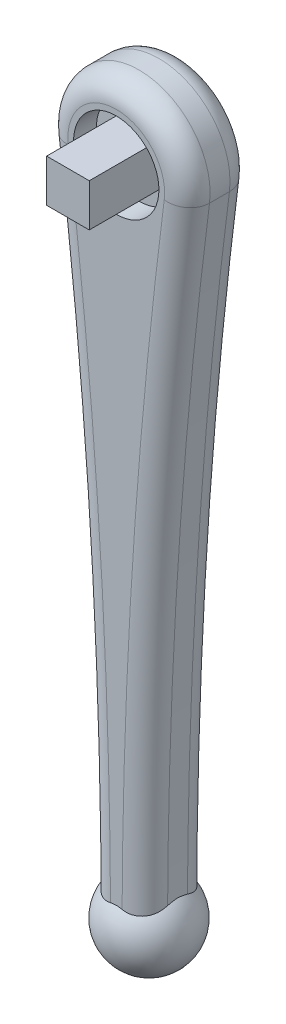
ISO-10303-21;
HEADER;
FILE_DESCRIPTION(('STEP AP214'),'2;1');
FILE_NAME('part.step','',(''),(''),'','','');
FILE_SCHEMA(('AUTOMOTIVE_DESIGN { 1 0 10303 214 1 1 1 1 }'));
ENDSEC;
DATA;
#1=APPLICATION_CONTEXT('core data for automotive mechanical design processes');
#2=APPLICATION_PROTOCOL_DEFINITION('international standard','automotive_design',2000,#1);
#3=PRODUCT_CONTEXT('',#1,'mechanical');
#4=PRODUCT('Part','Part','',(#3));
#5=PRODUCT_RELATED_PRODUCT_CATEGORY('part','',(#4));
#6=PRODUCT_DEFINITION_FORMATION('','',#4);
#7=PRODUCT_DEFINITION_CONTEXT('part definition',#1,'design');
#8=PRODUCT_DEFINITION('design','',#6,#7);
#9=PRODUCT_DEFINITION_SHAPE('','',#8);
#10=(LENGTH_UNIT() NAMED_UNIT(*) SI_UNIT(.MILLI.,.METRE.));
#11=(NAMED_UNIT(*) PLANE_ANGLE_UNIT() SI_UNIT($,.RADIAN.));
#12=(NAMED_UNIT(*) SI_UNIT($,.STERADIAN.) SOLID_ANGLE_UNIT());
#13=UNCERTAINTY_MEASURE_WITH_UNIT(LENGTH_MEASURE(1.E-05),#10,'distance_accuracy_value','');
#14=(GEOMETRIC_REPRESENTATION_CONTEXT(3) GLOBAL_UNCERTAINTY_ASSIGNED_CONTEXT((#13)) GLOBAL_UNIT_ASSIGNED_CONTEXT((#10,
#11,#12)) REPRESENTATION_CONTEXT('',''));
#15=CARTESIAN_POINT('',(0.,0.,0.));
#16=DIRECTION('',(0.,0.,1.));
#17=DIRECTION('',(1.,0.,0.));
#18=AXIS2_PLACEMENT_3D('',#15,#16,#17);
#19=CARTESIAN_POINT('',(0.,-235.,-3.5));
#20=DIRECTION('',(0.,1.,0.));
#21=DIRECTION('',(1.,0.,0.));
#22=AXIS2_PLACEMENT_3D('',#19,#20,#21);
#23=SPHERICAL_SURFACE('',#22,15.);
#24=CARTESIAN_POINT('',(0.,-220.,-3.5));
#25=VERTEX_POINT('',#24);
#26=VERTEX_LOOP('',#25);
#27=FACE_BOUND('',#26,.T.);
#28=ADVANCED_FACE('F41',(#27),#23,.T.);
#29=CLOSED_SHELL('',(#28));
#30=MANIFOLD_SOLID_BREP('B2',#29);
#31=CARTESIAN_POINT('',(1.17837495185956E-13,11.25,-18.5));
#32=DIRECTION('',(0.,0.,1.));
#33=DIRECTION('',(1.,0.,0.));
#34=AXIS2_PLACEMENT_3D('',#31,#32,#33);
#35=CYLINDRICAL_SURFACE('',#34,1.5);
#36=CARTESIAN_POINT('',(1.17837495185956E-13,11.25,0.));
#37=DIRECTION('',(0.,0.,-1.));
#38=DIRECTION('',(-1.,0.,0.));
#39=AXIS2_PLACEMENT_3D('',#36,#37,#38);
#40=CIRCLE('',#39,1.5);
#41=CARTESIAN_POINT('',(-1.49999999999988,11.25,0.));
#42=VERTEX_POINT('',#41);
#43=EDGE_CURVE('E385',#42,#42,#40,.T.);
#44=ORIENTED_EDGE('',*,*,#43,.F.);
#45=EDGE_LOOP('',(#44));
#46=FACE_BOUND('',#45,.T.);
#47=CARTESIAN_POINT('',(1.17837495185956E-13,11.25,-6.));
#48=DIRECTION('',(0.,0.,-1.));
#49=DIRECTION('',(-1.,0.,0.));
#50=AXIS2_PLACEMENT_3D('',#47,#48,#49);
#51=CIRCLE('',#50,1.5);
#52=CARTESIAN_POINT('',(-1.49999999999988,11.25,-6.));
#53=VERTEX_POINT('',#52);
#54=EDGE_CURVE('E58',#53,#53,#51,.F.);
#55=ORIENTED_EDGE('',*,*,#54,.F.);
#56=EDGE_LOOP('',(#55));
#57=FACE_BOUND('',#56,.T.);
#58=ADVANCED_FACE('F54',(#46,#57),#35,.F.);
#59=CARTESIAN_POINT('',(-11.25,0.,-18.5));
#60=DIRECTION('',(0.,0.,1.));
#61=DIRECTION('',(1.,0.,0.));
#62=AXIS2_PLACEMENT_3D('',#59,#60,#61);
#63=CYLINDRICAL_SURFACE('',#62,1.5);
#64=CARTESIAN_POINT('',(-11.25,0.,0.));
#65=DIRECTION('',(0.,0.,-1.));
#66=DIRECTION('',(-1.,0.,0.));
#67=AXIS2_PLACEMENT_3D('',#64,#65,#66);
#68=CIRCLE('',#67,1.5);
#69=CARTESIAN_POINT('',(-12.75,0.,0.));
#70=VERTEX_POINT('',#69);
#71=EDGE_CURVE('E382',#70,#70,#68,.T.);
#72=ORIENTED_EDGE('',*,*,#71,.F.);
#73=EDGE_LOOP('',(#72));
#74=FACE_BOUND('',#73,.T.);
#75=CARTESIAN_POINT('',(-11.25,0.,-6.));
#76=DIRECTION('',(0.,0.,-1.));
#77=DIRECTION('',(-1.,0.,0.));
#78=AXIS2_PLACEMENT_3D('',#75,#76,#77);
#79=CIRCLE('',#78,1.5);
#80=CARTESIAN_POINT('',(-12.75,0.,-6.));
#81=VERTEX_POINT('',#80);
#82=EDGE_CURVE('E409',#81,#81,#79,.T.);
#83=ORIENTED_EDGE('',*,*,#82,.T.);
#84=EDGE_LOOP('',(#83));
#85=FACE_BOUND('',#84,.T.);
#86=ADVANCED_FACE('F306',(#74,#85),#63,.F.);
#87=CARTESIAN_POINT('',(0.,-11.25,-18.5));
#88=DIRECTION('',(0.,0.,1.));
#89=DIRECTION('',(1.,0.,0.));
#90=AXIS2_PLACEMENT_3D('',#87,#88,#89);
#91=CYLINDRICAL_SURFACE('',#90,1.5);
#92=CARTESIAN_POINT('',(0.,-11.25,0.));
#93=DIRECTION('',(0.,0.,-1.));
#94=DIRECTION('',(-1.,0.,0.));
#95=AXIS2_PLACEMENT_3D('',#92,#93,#94);
#96=CIRCLE('',#95,1.5);
#97=CARTESIAN_POINT('',(-1.50000000000004,-11.25,0.));
#98=VERTEX_POINT('',#97);
#99=EDGE_CURVE('E379',#98,#98,#96,.T.);
#100=ORIENTED_EDGE('',*,*,#99,.F.);
#101=EDGE_LOOP('',(#100));
#102=FACE_BOUND('',#101,.T.);
#103=CARTESIAN_POINT('',(0.,-11.25,-6.));
#104=DIRECTION('',(0.,0.,-1.));
#105=DIRECTION('',(-1.,0.,0.));
#106=AXIS2_PLACEMENT_3D('',#103,#104,#105);
#107=CIRCLE('',#106,1.5);
#108=CARTESIAN_POINT('',(-1.50000000000004,-11.25,-6.));
#109=VERTEX_POINT('',#108);
#110=EDGE_CURVE('E401',#109,#109,#107,.T.);
#111=ORIENTED_EDGE('',*,*,#110,.T.);
#112=EDGE_LOOP('',(#111));
#113=FACE_BOUND('',#112,.T.);
#114=ADVANCED_FACE('F312',(#102,#113),#91,.F.);
#115=CARTESIAN_POINT('',(11.25,0.,-18.5));
#116=DIRECTION('',(0.,0.,1.));
#117=DIRECTION('',(1.,0.,0.));
#118=AXIS2_PLACEMENT_3D('',#115,#116,#117);
#119=CYLINDRICAL_SURFACE('',#118,1.5);
#120=CARTESIAN_POINT('',(11.25,0.,0.));
#121=DIRECTION('',(0.,0.,-1.));
#122=DIRECTION('',(-1.,0.,0.));
#123=AXIS2_PLACEMENT_3D('',#120,#121,#122);
#124=CIRCLE('',#123,1.5);
#125=CARTESIAN_POINT('',(9.75,0.,0.));
#126=VERTEX_POINT('',#125);
#127=EDGE_CURVE('E231',#126,#126,#124,.T.);
#128=ORIENTED_EDGE('',*,*,#127,.F.);
#129=EDGE_LOOP('',(#128));
#130=FACE_BOUND('',#129,.T.);
#131=CARTESIAN_POINT('',(11.25,0.,-6.));
#132=DIRECTION('',(0.,0.,-1.));
#133=DIRECTION('',(-1.,0.,0.));
#134=AXIS2_PLACEMENT_3D('',#131,#132,#133);
#135=CIRCLE('',#134,1.5);
#136=CARTESIAN_POINT('',(9.75,0.,-6.));
#137=VERTEX_POINT('',#136);
#138=EDGE_CURVE('E395',#137,#137,#135,.T.);
#139=ORIENTED_EDGE('',*,*,#138,.T.);
#140=EDGE_LOOP('',(#139));
#141=FACE_BOUND('',#140,.T.);
#142=ADVANCED_FACE('F299',(#130,#141),#119,.F.);
#143=CARTESIAN_POINT('',(0.,0.,8.));
#144=DIRECTION('',(0.,0.,-1.));
#145=DIRECTION('',(-1.,0.,0.));
#146=AXIS2_PLACEMENT_3D('',#143,#144,#145);
#147=CYLINDRICAL_SURFACE('',#146,25.);
#148=DIRECTION('',(0.,0.,-1.));
#149=VECTOR('',#148,1.);
#150=CARTESIAN_POINT('',(-24.7971145175834,-3.1785392245266,254.854626136875));
#151=LINE('',#150,#149);
#152=CARTESIAN_POINT('',(-24.7971145175834,-3.1785392245266,0.));
#153=VERTEX_POINT('',#152);
#154=CARTESIAN_POINT('',(-24.7971145175834,-3.1785392245266,-7.00000000000001));
#155=VERTEX_POINT('',#154);
#156=EDGE_CURVE('E263',#153,#155,#151,.T.);
#157=ORIENTED_EDGE('',*,*,#156,.F.);
#158=CARTESIAN_POINT('',(0.,0.,0.));
#159=DIRECTION('',(0.,0.,1.));
#160=DIRECTION('',(1.,0.,0.));
#161=AXIS2_PLACEMENT_3D('',#158,#159,#160);
#162=CIRCLE('',#161,25.);
#163=CARTESIAN_POINT('',(24.7971145175834,-3.17853922452661,0.));
#164=VERTEX_POINT('',#163);
#165=EDGE_CURVE('E63',#153,#164,#162,.F.);
#166=ORIENTED_EDGE('',*,*,#165,.T.);
#167=DIRECTION('',(0.,0.,-1.));
#168=VECTOR('',#167,1.);
#169=CARTESIAN_POINT('',(24.7971145175834,-3.17853922452661,254.854626136875));
#170=LINE('',#169,#168);
#171=CARTESIAN_POINT('',(24.7971145175834,-3.17853922452661,-7.00000000000001));
#172=VERTEX_POINT('',#171);
#173=EDGE_CURVE('E265',#164,#172,#170,.T.);
#174=ORIENTED_EDGE('',*,*,#173,.T.);
#175=CARTESIAN_POINT('',(0.,0.,-7.));
#176=DIRECTION('',(0.,0.,-1.));
#177=DIRECTION('',(-1.,0.,0.));
#178=AXIS2_PLACEMENT_3D('',#175,#176,#177);
#179=CIRCLE('',#178,25.);
#180=EDGE_CURVE('E195',#172,#155,#179,.F.);
#181=ORIENTED_EDGE('',*,*,#180,.T.);
#182=EDGE_LOOP('',(#157,#166,#174,#181));
#183=FACE_BOUND('',#182,.T.);
#184=ADVANCED_FACE('F290',(#183),#147,.T.);
#185=CARTESIAN_POINT('',(0.,0.,0.));
#186=DIRECTION('',(0.,0.,-1.));
#187=DIRECTION('',(-1.,0.,0.));
#188=AXIS2_PLACEMENT_3D('',#185,#186,#187);
#189=PLANE('',#188);
#190=ORIENTED_EDGE('',*,*,#127,.T.);
#191=EDGE_LOOP('',(#190));
#192=FACE_BOUND('',#191,.T.);
#193=ORIENTED_EDGE('',*,*,#99,.T.);
#194=EDGE_LOOP('',(#193));
#195=FACE_BOUND('',#194,.T.);
#196=ORIENTED_EDGE('',*,*,#71,.T.);
#197=EDGE_LOOP('',(#196));
#198=FACE_BOUND('',#197,.T.);
#199=ORIENTED_EDGE('',*,*,#43,.T.);
#200=EDGE_LOOP('',(#199));
#201=FACE_BOUND('',#200,.T.);
#202=CARTESIAN_POINT('',(0.,0.,0.));
#203=DIRECTION('',(0.,0.,1.));
#204=DIRECTION('',(1.,0.,0.));
#205=AXIS2_PLACEMENT_3D('',#202,#203,#204);
#206=CIRCLE('',#205,15.);
#207=CARTESIAN_POINT('',(15.,0.,0.));
#208=VERTEX_POINT('',#207);
#209=EDGE_CURVE('E169',#208,#208,#206,.T.);
#210=ORIENTED_EDGE('',*,*,#209,.T.);
#211=EDGE_LOOP('',(#210));
#212=FACE_BOUND('',#211,.T.);
#213=DIRECTION('',(0.,1.,0.));
#214=VECTOR('',#213,1.);
#215=CARTESIAN_POINT('',(7.5,-7.5,0.));
#216=LINE('',#215,#214);
#217=CARTESIAN_POINT('',(7.5,-7.5,0.));
#218=VERTEX_POINT('',#217);
#219=CARTESIAN_POINT('',(7.5,7.5,0.));
#220=VERTEX_POINT('',#219);
#221=EDGE_CURVE('E168',#218,#220,#216,.T.);
#222=ORIENTED_EDGE('',*,*,#221,.F.);
#223=DIRECTION('',(1.,0.,0.));
#224=VECTOR('',#223,1.);
#225=CARTESIAN_POINT('',(-7.5,-7.5,0.));
#226=LINE('',#225,#224);
#227=CARTESIAN_POINT('',(-7.5,-7.5,0.));
#228=VERTEX_POINT('',#227);
#229=EDGE_CURVE('E165',#228,#218,#226,.T.);
#230=ORIENTED_EDGE('',*,*,#229,.F.);
#231=DIRECTION('',(0.,-1.,0.));
#232=VECTOR('',#231,1.);
#233=CARTESIAN_POINT('',(-7.5,-7.5,0.));
#234=LINE('',#233,#232);
#235=CARTESIAN_POINT('',(-7.5,7.5,0.));
#236=VERTEX_POINT('',#235);
#237=EDGE_CURVE('E276',#236,#228,#234,.T.);
#238=ORIENTED_EDGE('',*,*,#237,.F.);
#239=DIRECTION('',(-1.,0.,0.));
#240=VECTOR('',#239,1.);
#241=CARTESIAN_POINT('',(-7.5,7.5,0.));
#242=LINE('',#241,#240);
#243=EDGE_CURVE('E274',#220,#236,#242,.T.);
#244=ORIENTED_EDGE('',*,*,#243,.F.);
#245=EDGE_LOOP('',(#222,#230,#238,#244));
#246=FACE_BOUND('',#245,.T.);
#247=ADVANCED_FACE('F288',(#192,#195,#198,#201,#212,#246),#189,.F.);
#248=CARTESIAN_POINT('',(0.,0.,8.));
#249=DIRECTION('',(0.,0.,1.));
#250=DIRECTION('',(1.,0.,0.));
#251=AXIS2_PLACEMENT_3D('',#248,#249,#250);
#252=PLANE('',#251);
#253=CARTESIAN_POINT('',(-1833.33333333333,-235.,8.));
#254=DIRECTION('',(0.,0.,1.));
#255=DIRECTION('',(1.,0.,0.));
#256=AXIS2_PLACEMENT_3D('',#253,#254,#255);
#257=CIRCLE('',#256,1831.33333333333);
#258=CARTESIAN_POINT('',(-16.8620378719567,-2.16140667267809,8.));
#259=VERTEX_POINT('',#258);
#260=CARTESIAN_POINT('',(-2.00000000000026,-235.,8.));
#261=VERTEX_POINT('',#260);
#262=EDGE_CURVE('E221',#259,#261,#257,.F.);
#263=ORIENTED_EDGE('',*,*,#262,.T.);
#264=CARTESIAN_POINT('',(0.,-235.,8.));
#265=DIRECTION('',(0.,0.,1.));
#266=DIRECTION('',(1.,0.,0.));
#267=AXIS2_PLACEMENT_3D('',#264,#265,#266);
#268=CIRCLE('',#267,2.00000000000001);
#269=CARTESIAN_POINT('',(1.99999999999998,-235.,8.));
#270=VERTEX_POINT('',#269);
#271=EDGE_CURVE('E223',#261,#270,#268,.T.);
#272=ORIENTED_EDGE('',*,*,#271,.T.);
#273=CARTESIAN_POINT('',(1833.33333333333,-235.,8.));
#274=DIRECTION('',(0.,0.,1.));
#275=DIRECTION('',(1.,0.,0.));
#276=AXIS2_PLACEMENT_3D('',#273,#274,#275);
#277=CIRCLE('',#276,1831.33333333333);
#278=CARTESIAN_POINT('',(16.8620378719569,-2.16140667267812,8.));
#279=VERTEX_POINT('',#278);
#280=EDGE_CURVE('E217',#270,#279,#277,.F.);
#281=ORIENTED_EDGE('',*,*,#280,.T.);
#282=CARTESIAN_POINT('',(0.,0.,8.));
#283=DIRECTION('',(0.,0.,1.));
#284=DIRECTION('',(1.,0.,0.));
#285=AXIS2_PLACEMENT_3D('',#282,#283,#284);
#286=CIRCLE('',#285,17.);
#287=EDGE_CURVE('E219',#279,#259,#286,.T.);
#288=ORIENTED_EDGE('',*,*,#287,.T.);
#289=EDGE_LOOP('',(#263,#272,#281,#288));
#290=FACE_BOUND('',#289,.T.);
#291=CARTESIAN_POINT('',(0.,0.,8.));
#292=DIRECTION('',(0.,0.,1.));
#293=DIRECTION('',(1.,0.,0.));
#294=AXIS2_PLACEMENT_3D('',#291,#292,#293);
#295=CIRCLE('',#294,15.);
#296=CARTESIAN_POINT('',(15.,0.,8.));
#297=VERTEX_POINT('',#296);
#298=EDGE_CURVE('E172',#297,#297,#295,.T.);
#299=ORIENTED_EDGE('',*,*,#298,.F.);
#300=EDGE_LOOP('',(#299));
#301=FACE_BOUND('',#300,.T.);
#302=ADVANCED_FACE('F247',(#290,#301),#252,.T.);
#303=CARTESIAN_POINT('',(0.,0.,8.));
#304=DIRECTION('',(0.,0.,-1.));
#305=DIRECTION('',(-1.,0.,0.));
#306=AXIS2_PLACEMENT_3D('',#303,#304,#305);
#307=CYLINDRICAL_SURFACE('',#306,15.);
#308=ORIENTED_EDGE('',*,*,#298,.T.);
#309=EDGE_LOOP('',(#308));
#310=FACE_BOUND('',#309,.T.);
#311=ORIENTED_EDGE('',*,*,#209,.F.);
#312=EDGE_LOOP('',(#311));
#313=FACE_BOUND('',#312,.T.);
#314=ADVANCED_FACE('F297',(#310,#313),#307,.F.);
#315=CARTESIAN_POINT('',(0.,0.,-15.));
#316=DIRECTION('',(0.,0.,-1.));
#317=DIRECTION('',(-1.,0.,0.));
#318=AXIS2_PLACEMENT_3D('',#315,#316,#317);
#319=PLANE('',#318);
#320=CARTESIAN_POINT('',(-11.2500000000003,4.38270590102521E-13,-15.));
#321=DIRECTION('',(0.,0.,-1.));
#322=DIRECTION('',(-1.,0.,0.));
#323=AXIS2_PLACEMENT_3D('',#320,#321,#322);
#324=CIRCLE('',#323,3.50000000000025);
#325=CARTESIAN_POINT('',(-14.7500000000006,4.38270590102521E-13,-15.));
#326=VERTEX_POINT('',#325);
#327=EDGE_CURVE('E347',#326,#326,#324,.T.);
#328=ORIENTED_EDGE('',*,*,#327,.F.);
#329=EDGE_LOOP('',(#328));
#330=FACE_BOUND('',#329,.T.);
#331=CARTESIAN_POINT('',(-7.58703685019087E-13,-11.25,-15.));
#332=DIRECTION('',(0.,0.,-1.));
#333=DIRECTION('',(-1.,0.,0.));
#334=AXIS2_PLACEMENT_3D('',#331,#332,#333);
#335=CIRCLE('',#334,3.50000000000069);
#336=CARTESIAN_POINT('',(-3.50000000000145,-11.25,-15.));
#337=VERTEX_POINT('',#336);
#338=EDGE_CURVE('E351',#337,#337,#335,.T.);
#339=ORIENTED_EDGE('',*,*,#338,.F.);
#340=EDGE_LOOP('',(#339));
#341=FACE_BOUND('',#340,.T.);
#342=CARTESIAN_POINT('',(11.2499999999997,-4.39648317751562E-13,-15.));
#343=DIRECTION('',(0.,0.,-1.));
#344=DIRECTION('',(-1.,0.,0.));
#345=AXIS2_PLACEMENT_3D('',#342,#343,#344);
#346=CIRCLE('',#345,3.50000000000051);
#347=CARTESIAN_POINT('',(7.74999999999917,-4.39648317751562E-13,-15.));
#348=VERTEX_POINT('',#347);
#349=EDGE_CURVE('E355',#348,#348,#346,.T.);
#350=ORIENTED_EDGE('',*,*,#349,.F.);
#351=EDGE_LOOP('',(#350));
#352=FACE_BOUND('',#351,.T.);
#353=CARTESIAN_POINT('',(1.17837495185956E-13,11.25,-15.));
#354=DIRECTION('',(0.,0.,-1.));
#355=DIRECTION('',(-1.,0.,0.));
#356=AXIS2_PLACEMENT_3D('',#353,#354,#355);
#357=CIRCLE('',#356,3.5);
#358=CARTESIAN_POINT('',(-3.49999999999988,11.25,-15.));
#359=VERTEX_POINT('',#358);
#360=EDGE_CURVE('E359',#359,#359,#357,.T.);
#361=ORIENTED_EDGE('',*,*,#360,.F.);
#362=EDGE_LOOP('',(#361));
#363=FACE_BOUND('',#362,.T.);
#364=CARTESIAN_POINT('',(1833.33333333333,-235.,-15.));
#365=DIRECTION('',(0.,0.,-1.));
#366=DIRECTION('',(-1.,0.,0.));
#367=AXIS2_PLACEMENT_3D('',#364,#365,#366);
#368=CIRCLE('',#367,1831.33333333333);
#369=CARTESIAN_POINT('',(16.8620378719569,-2.16140667267812,-15.));
#370=VERTEX_POINT('',#369);
#371=CARTESIAN_POINT('',(1.99999999999998,-235.,-15.));
#372=VERTEX_POINT('',#371);
#373=EDGE_CURVE('E179',#370,#372,#368,.F.);
#374=ORIENTED_EDGE('',*,*,#373,.T.);
#375=CARTESIAN_POINT('',(0.,-235.,-15.));
#376=DIRECTION('',(0.,0.,-1.));
#377=DIRECTION('',(-1.,0.,0.));
#378=AXIS2_PLACEMENT_3D('',#375,#376,#377);
#379=CIRCLE('',#378,2.00000000000001);
#380=CARTESIAN_POINT('',(-2.00000000000026,-235.,-15.));
#381=VERTEX_POINT('',#380);
#382=EDGE_CURVE('E186',#372,#381,#379,.T.);
#383=ORIENTED_EDGE('',*,*,#382,.T.);
#384=CARTESIAN_POINT('',(-1833.33333333333,-235.,-15.));
#385=DIRECTION('',(0.,0.,-1.));
#386=DIRECTION('',(-1.,0.,0.));
#387=AXIS2_PLACEMENT_3D('',#384,#385,#386);
#388=CIRCLE('',#387,1831.33333333333);
#389=CARTESIAN_POINT('',(-16.8620378719567,-2.16140667267809,-15.));
#390=VERTEX_POINT('',#389);
#391=EDGE_CURVE('E184',#381,#390,#388,.F.);
#392=ORIENTED_EDGE('',*,*,#391,.T.);
#393=CARTESIAN_POINT('',(0.,0.,-15.));
#394=DIRECTION('',(0.,0.,-1.));
#395=DIRECTION('',(-1.,0.,0.));
#396=AXIS2_PLACEMENT_3D('',#393,#394,#395);
#397=CIRCLE('',#396,17.);
#398=EDGE_CURVE('E182',#390,#370,#397,.T.);
#399=ORIENTED_EDGE('',*,*,#398,.T.);
#400=EDGE_LOOP('',(#374,#383,#392,#399));
#401=FACE_BOUND('',#400,.T.);
#402=ADVANCED_FACE('F337',(#330,#341,#352,#363,#401),#319,.T.);
#403=CARTESIAN_POINT('',(7.5,-7.5,25.));
#404=DIRECTION('',(-1.,0.,0.));
#405=DIRECTION('',(0.,0.,1.));
#406=AXIS2_PLACEMENT_3D('',#403,#404,#405);
#407=PLANE('',#406);
#408=ORIENTED_EDGE('',*,*,#221,.T.);
#409=DIRECTION('',(0.,0.,-1.));
#410=VECTOR('',#409,1.);
#411=CARTESIAN_POINT('',(7.5,7.5,25.));
#412=LINE('',#411,#410);
#413=CARTESIAN_POINT('',(7.5,7.5,25.));
#414=VERTEX_POINT('',#413);
#415=EDGE_CURVE('E149',#414,#220,#412,.T.);
#416=ORIENTED_EDGE('',*,*,#415,.F.);
#417=DIRECTION('',(0.,1.,0.));
#418=VECTOR('',#417,1.);
#419=CARTESIAN_POINT('',(7.5,-7.5,25.));
#420=LINE('',#419,#418);
#421=CARTESIAN_POINT('',(7.5,-7.5,25.));
#422=VERTEX_POINT('',#421);
#423=EDGE_CURVE('E156',#422,#414,#420,.T.);
#424=ORIENTED_EDGE('',*,*,#423,.F.);
#425=DIRECTION('',(0.,0.,-1.));
#426=VECTOR('',#425,1.);
#427=CARTESIAN_POINT('',(7.5,-7.5,25.));
#428=LINE('',#427,#426);
#429=EDGE_CURVE('E272',#422,#218,#428,.T.);
#430=ORIENTED_EDGE('',*,*,#429,.T.);
#431=EDGE_LOOP('',(#408,#416,#424,#430));
#432=FACE_BOUND('',#431,.T.);
#433=ADVANCED_FACE('F167',(#432),#407,.F.);
#434=CARTESIAN_POINT('',(-7.5,7.5,25.));
#435=DIRECTION('',(0.,-1.,0.));
#436=DIRECTION('',(0.,0.,-1.));
#437=AXIS2_PLACEMENT_3D('',#434,#435,#436);
#438=PLANE('',#437);
#439=ORIENTED_EDGE('',*,*,#243,.T.);
#440=DIRECTION('',(0.,0.,-1.));
#441=VECTOR('',#440,1.);
#442=CARTESIAN_POINT('',(-7.5,7.5,25.));
#443=LINE('',#442,#441);
#444=CARTESIAN_POINT('',(-7.5,7.5,25.));
#445=VERTEX_POINT('',#444);
#446=EDGE_CURVE('E152',#445,#236,#443,.T.);
#447=ORIENTED_EDGE('',*,*,#446,.F.);
#448=DIRECTION('',(-1.,0.,0.));
#449=VECTOR('',#448,1.);
#450=CARTESIAN_POINT('',(-7.5,7.5,25.));
#451=LINE('',#450,#449);
#452=EDGE_CURVE('E144',#414,#445,#451,.T.);
#453=ORIENTED_EDGE('',*,*,#452,.F.);
#454=ORIENTED_EDGE('',*,*,#415,.T.);
#455=EDGE_LOOP('',(#439,#447,#453,#454));
#456=FACE_BOUND('',#455,.T.);
#457=ADVANCED_FACE('F147',(#456),#438,.F.);
#458=CARTESIAN_POINT('',(-7.5,-7.5,25.));
#459=DIRECTION('',(1.,0.,0.));
#460=DIRECTION('',(0.,0.,-1.));
#461=AXIS2_PLACEMENT_3D('',#458,#459,#460);
#462=PLANE('',#461);
#463=ORIENTED_EDGE('',*,*,#237,.T.);
#464=DIRECTION('',(0.,0.,-1.));
#465=VECTOR('',#464,1.);
#466=CARTESIAN_POINT('',(-7.5,-7.5,25.));
#467=LINE('',#466,#465);
#468=CARTESIAN_POINT('',(-7.5,-7.5,25.));
#469=VERTEX_POINT('',#468);
#470=EDGE_CURVE('E174',#469,#228,#467,.T.);
#471=ORIENTED_EDGE('',*,*,#470,.F.);
#472=DIRECTION('',(0.,-1.,0.));
#473=VECTOR('',#472,1.);
#474=CARTESIAN_POINT('',(-7.5,-7.5,25.));
#475=LINE('',#474,#473);
#476=EDGE_CURVE('E155',#445,#469,#475,.T.);
#477=ORIENTED_EDGE('',*,*,#476,.F.);
#478=ORIENTED_EDGE('',*,*,#446,.T.);
#479=EDGE_LOOP('',(#463,#471,#477,#478));
#480=FACE_BOUND('',#479,.T.);
#481=ADVANCED_FACE('F286',(#480),#462,.F.);
#482=CARTESIAN_POINT('',(-7.5,-7.5,25.));
#483=DIRECTION('',(0.,1.,0.));
#484=DIRECTION('',(0.,0.,1.));
#485=AXIS2_PLACEMENT_3D('',#482,#483,#484);
#486=PLANE('',#485);
#487=ORIENTED_EDGE('',*,*,#229,.T.);
#488=ORIENTED_EDGE('',*,*,#429,.F.);
#489=DIRECTION('',(1.,0.,0.));
#490=VECTOR('',#489,1.);
#491=CARTESIAN_POINT('',(-7.5,-7.5,25.));
#492=LINE('',#491,#490);
#493=EDGE_CURVE('E161',#469,#422,#492,.T.);
#494=ORIENTED_EDGE('',*,*,#493,.F.);
#495=ORIENTED_EDGE('',*,*,#470,.T.);
#496=EDGE_LOOP('',(#487,#488,#494,#495));
#497=FACE_BOUND('',#496,.T.);
#498=ADVANCED_FACE('F284',(#497),#486,.F.);
#499=CARTESIAN_POINT('',(0.,0.,25.));
#500=DIRECTION('',(0.,0.,-1.));
#501=DIRECTION('',(-1.,0.,0.));
#502=AXIS2_PLACEMENT_3D('',#499,#500,#501);
#503=PLANE('',#502);
#504=ORIENTED_EDGE('',*,*,#423,.T.);
#505=ORIENTED_EDGE('',*,*,#452,.T.);
#506=ORIENTED_EDGE('',*,*,#476,.T.);
#507=ORIENTED_EDGE('',*,*,#493,.T.);
#508=EDGE_LOOP('',(#504,#505,#506,#507));
#509=FACE_BOUND('',#508,.T.);
#510=ADVANCED_FACE('F159',(#509),#503,.F.);
#511=CARTESIAN_POINT('',(0.,-235.,254.854626136875));
#512=DIRECTION('',(0.,0.,-1.));
#513=DIRECTION('',(-1.,0.,0.));
#514=AXIS2_PLACEMENT_3D('',#511,#512,#513);
#515=CYLINDRICAL_SURFACE('',#514,10.);
#516=DIRECTION('',(0.,0.,-1.));
#517=VECTOR('',#516,1.);
#518=CARTESIAN_POINT('',(9.99999999999998,-235.,254.854626136875));
#519=LINE('',#518,#517);
#520=CARTESIAN_POINT('',(9.99999999999998,-235.,0.));
#521=VERTEX_POINT('',#520);
#522=CARTESIAN_POINT('',(9.99999999999998,-235.,-7.00000000000001));
#523=VERTEX_POINT('',#522);
#524=EDGE_CURVE('E259',#521,#523,#519,.T.);
#525=ORIENTED_EDGE('',*,*,#524,.F.);
#526=CARTESIAN_POINT('',(0.,-235.,0.));
#527=DIRECTION('',(0.,0.,1.));
#528=DIRECTION('',(1.,0.,0.));
#529=AXIS2_PLACEMENT_3D('',#526,#527,#528);
#530=CIRCLE('',#529,10.);
#531=CARTESIAN_POINT('',(-10.,-235.,0.));
#532=VERTEX_POINT('',#531);
#533=EDGE_CURVE('E201',#521,#532,#530,.F.);
#534=ORIENTED_EDGE('',*,*,#533,.T.);
#535=DIRECTION('',(0.,0.,-1.));
#536=VECTOR('',#535,1.);
#537=CARTESIAN_POINT('',(-10.,-235.,254.854626136875));
#538=LINE('',#537,#536);
#539=CARTESIAN_POINT('',(-10.,-235.,-7.00000000000001));
#540=VERTEX_POINT('',#539);
#541=EDGE_CURVE('E214',#532,#540,#538,.T.);
#542=ORIENTED_EDGE('',*,*,#541,.T.);
#543=CARTESIAN_POINT('',(0.,-235.,-7.00000000000001));
#544=DIRECTION('',(0.,0.,-1.));
#545=DIRECTION('',(-1.,0.,0.));
#546=AXIS2_PLACEMENT_3D('',#543,#544,#545);
#547=CIRCLE('',#546,10.);
#548=EDGE_CURVE('E189',#540,#523,#547,.F.);
#549=ORIENTED_EDGE('',*,*,#548,.T.);
#550=EDGE_LOOP('',(#525,#534,#542,#549));
#551=FACE_BOUND('',#550,.T.);
#552=ADVANCED_FACE('F258',(#551),#515,.T.);
#553=CARTESIAN_POINT('',(-1833.33333333333,-235.,254.854626136875));
#554=DIRECTION('',(0.,0.,-1.));
#555=DIRECTION('',(-1.,0.,0.));
#556=AXIS2_PLACEMENT_3D('',#553,#554,#555);
#557=CYLINDRICAL_SURFACE('',#556,1823.33333333333);
#558=ORIENTED_EDGE('',*,*,#541,.F.);
#559=CARTESIAN_POINT('',(-1833.33333333333,-235.,0.));
#560=DIRECTION('',(0.,0.,1.));
#561=DIRECTION('',(1.,0.,0.));
#562=AXIS2_PLACEMENT_3D('',#559,#560,#561);
#563=CIRCLE('',#562,1823.33333333333);
#564=EDGE_CURVE('E78',#532,#153,#563,.T.);
#565=ORIENTED_EDGE('',*,*,#564,.T.);
#566=ORIENTED_EDGE('',*,*,#156,.T.);
#567=CARTESIAN_POINT('',(-1833.33333333333,-235.,-7.00000000000001));
#568=DIRECTION('',(0.,0.,-1.));
#569=DIRECTION('',(-1.,0.,0.));
#570=AXIS2_PLACEMENT_3D('',#567,#568,#569);
#571=CIRCLE('',#570,1823.33333333333);
#572=EDGE_CURVE('E192',#155,#540,#571,.T.);
#573=ORIENTED_EDGE('',*,*,#572,.T.);
#574=EDGE_LOOP('',(#558,#565,#566,#573));
#575=FACE_BOUND('',#574,.T.);
#576=ADVANCED_FACE('F260',(#575),#557,.F.);
#577=CARTESIAN_POINT('',(1833.33333333333,-235.,254.854626136875));
#578=DIRECTION('',(0.,0.,-1.));
#579=DIRECTION('',(-1.,0.,0.));
#580=AXIS2_PLACEMENT_3D('',#577,#578,#579);
#581=CYLINDRICAL_SURFACE('',#580,1823.33333333333);
#582=ORIENTED_EDGE('',*,*,#173,.F.);
#583=CARTESIAN_POINT('',(1833.33333333333,-235.,0.));
#584=DIRECTION('',(0.,0.,1.));
#585=DIRECTION('',(1.,0.,0.));
#586=AXIS2_PLACEMENT_3D('',#583,#584,#585);
#587=CIRCLE('',#586,1823.33333333333);
#588=EDGE_CURVE('E39',#164,#521,#587,.T.);
#589=ORIENTED_EDGE('',*,*,#588,.T.);
#590=ORIENTED_EDGE('',*,*,#524,.T.);
#591=CARTESIAN_POINT('',(1833.33333333333,-235.,-7.00000000000001));
#592=DIRECTION('',(0.,0.,-1.));
#593=DIRECTION('',(-1.,0.,0.));
#594=AXIS2_PLACEMENT_3D('',#591,#592,#593);
#595=CIRCLE('',#594,1823.33333333333);
#596=EDGE_CURVE('E198',#523,#172,#595,.T.);
#597=ORIENTED_EDGE('',*,*,#596,.T.);
#598=EDGE_LOOP('',(#582,#589,#590,#597));
#599=FACE_BOUND('',#598,.T.);
#600=ADVANCED_FACE('F319',(#599),#581,.F.);
#601=CARTESIAN_POINT('',(0.,0.,-7.));
#602=DIRECTION('',(0.,0.,-1.));
#603=DIRECTION('',(-1.,0.,0.));
#604=AXIS2_PLACEMENT_3D('',#601,#602,#603);
#605=TOROIDAL_SURFACE('',#604,17.,8.);
#606=CARTESIAN_POINT('',(-16.8620378719567,-2.16140667267809,-7.));
#607=DIRECTION('',(0.127141568981064,-0.991884580703336,0.));
#608=DIRECTION('',(0.991884580703336,0.127141568981064,0.));
#609=AXIS2_PLACEMENT_3D('',#606,#607,#608);
#610=CIRCLE('',#609,8.);
#611=EDGE_CURVE('E208',#155,#390,#610,.T.);
#612=ORIENTED_EDGE('',*,*,#611,.F.);
#613=ORIENTED_EDGE('',*,*,#180,.F.);
#614=CARTESIAN_POINT('',(16.8620378719567,-2.16140667267809,-7.));
#615=DIRECTION('',(-0.127141568981064,-0.991884580703336,0.));
#616=DIRECTION('',(0.991884580703336,-0.127141568981064,0.));
#617=AXIS2_PLACEMENT_3D('',#614,#615,#616);
#618=CIRCLE('',#617,8.);
#619=EDGE_CURVE('E211',#370,#172,#618,.T.);
#620=ORIENTED_EDGE('',*,*,#619,.F.);
#621=ORIENTED_EDGE('',*,*,#398,.F.);
#622=EDGE_LOOP('',(#612,#613,#620,#621));
#623=FACE_BOUND('',#622,.T.);
#624=ADVANCED_FACE('F322',(#623),#605,.T.);
#625=CARTESIAN_POINT('',(1833.33333333333,-235.,-7.00000000000001));
#626=DIRECTION('',(0.,0.,-1.));
#627=DIRECTION('',(-1.,0.,0.));
#628=AXIS2_PLACEMENT_3D('',#625,#626,#627);
#629=TOROIDAL_SURFACE('',#628,1831.33333333333,8.);
#630=ORIENTED_EDGE('',*,*,#619,.T.);
#631=ORIENTED_EDGE('',*,*,#596,.F.);
#632=CARTESIAN_POINT('',(1.99999999999998,-235.,-7.));
#633=DIRECTION('',(0.,-1.,0.));
#634=DIRECTION('',(0.,0.,-1.));
#635=AXIS2_PLACEMENT_3D('',#632,#633,#634);
#636=CIRCLE('',#635,8.);
#637=EDGE_CURVE('E204',#372,#523,#636,.T.);
#638=ORIENTED_EDGE('',*,*,#637,.F.);
#639=ORIENTED_EDGE('',*,*,#373,.F.);
#640=EDGE_LOOP('',(#630,#631,#638,#639));
#641=FACE_BOUND('',#640,.T.);
#642=ADVANCED_FACE('F367',(#641),#629,.T.);
#643=CARTESIAN_POINT('',(-1833.33333333333,-235.,-7.00000000000001));
#644=DIRECTION('',(0.,0.,-1.));
#645=DIRECTION('',(-1.,0.,0.));
#646=AXIS2_PLACEMENT_3D('',#643,#644,#645);
#647=TOROIDAL_SURFACE('',#646,1831.33333333333,8.);
#648=ORIENTED_EDGE('',*,*,#611,.T.);
#649=ORIENTED_EDGE('',*,*,#391,.F.);
#650=CARTESIAN_POINT('',(-2.00000000000026,-235.,-7.00000000000001));
#651=DIRECTION('',(0.,-1.,0.));
#652=DIRECTION('',(0.,0.,-1.));
#653=AXIS2_PLACEMENT_3D('',#650,#651,#652);
#654=CIRCLE('',#653,8.);
#655=EDGE_CURVE('E202',#540,#381,#654,.T.);
#656=ORIENTED_EDGE('',*,*,#655,.F.);
#657=ORIENTED_EDGE('',*,*,#572,.F.);
#658=EDGE_LOOP('',(#648,#649,#656,#657));
#659=FACE_BOUND('',#658,.T.);
#660=ADVANCED_FACE('F373',(#659),#647,.T.);
#661=CARTESIAN_POINT('',(0.,-235.,-7.00000000000001));
#662=DIRECTION('',(0.,0.,-1.));
#663=DIRECTION('',(-1.,0.,0.));
#664=AXIS2_PLACEMENT_3D('',#661,#662,#663);
#665=DEGENERATE_TOROIDAL_SURFACE('',#664,2.00000000000001,8.,.T.);
#666=ORIENTED_EDGE('',*,*,#637,.T.);
#667=ORIENTED_EDGE('',*,*,#548,.F.);
#668=ORIENTED_EDGE('',*,*,#655,.T.);
#669=ORIENTED_EDGE('',*,*,#382,.F.);
#670=EDGE_LOOP('',(#666,#667,#668,#669));
#671=FACE_BOUND('',#670,.T.);
#672=ADVANCED_FACE('F369',(#671),#665,.T.);
#673=CARTESIAN_POINT('',(0.,0.,0.));
#674=DIRECTION('',(0.,0.,1.));
#675=DIRECTION('',(1.,0.,0.));
#676=AXIS2_PLACEMENT_3D('',#673,#674,#675);
#677=TOROIDAL_SURFACE('',#676,17.,8.);
#678=CARTESIAN_POINT('',(-16.8620378719567,-2.16140667267809,0.));
#679=DIRECTION('',(0.127141568981064,-0.991884580703336,0.));
#680=DIRECTION('',(0.991884580703337,0.127141568981064,0.));
#681=AXIS2_PLACEMENT_3D('',#678,#679,#680);
#682=CIRCLE('',#681,8.);
#683=EDGE_CURVE('E233',#259,#153,#682,.T.);
#684=ORIENTED_EDGE('',*,*,#683,.F.);
#685=ORIENTED_EDGE('',*,*,#287,.F.);
#686=CARTESIAN_POINT('',(16.8620378719567,-2.16140667267809,0.));
#687=DIRECTION('',(-0.127141568981064,-0.991884580703336,0.));
#688=DIRECTION('',(0.991884580703336,-0.127141568981064,0.));
#689=AXIS2_PLACEMENT_3D('',#686,#687,#688);
#690=CIRCLE('',#689,8.);
#691=EDGE_CURVE('E205',#164,#279,#690,.T.);
#692=ORIENTED_EDGE('',*,*,#691,.F.);
#693=ORIENTED_EDGE('',*,*,#165,.F.);
#694=EDGE_LOOP('',(#684,#685,#692,#693));
#695=FACE_BOUND('',#694,.T.);
#696=ADVANCED_FACE('F56',(#695),#677,.T.);
#697=CARTESIAN_POINT('',(1833.33333333333,-235.,0.));
#698=DIRECTION('',(0.,0.,1.));
#699=DIRECTION('',(1.,0.,0.));
#700=AXIS2_PLACEMENT_3D('',#697,#698,#699);
#701=TOROIDAL_SURFACE('',#700,1831.33333333333,8.);
#702=ORIENTED_EDGE('',*,*,#691,.T.);
#703=ORIENTED_EDGE('',*,*,#280,.F.);
#704=CARTESIAN_POINT('',(1.99999999999998,-235.,0.));
#705=DIRECTION('',(0.,-1.,0.));
#706=DIRECTION('',(0.,0.,-1.));
#707=AXIS2_PLACEMENT_3D('',#704,#705,#706);
#708=CIRCLE('',#707,8.);
#709=EDGE_CURVE('E230',#521,#270,#708,.T.);
#710=ORIENTED_EDGE('',*,*,#709,.F.);
#711=ORIENTED_EDGE('',*,*,#588,.F.);
#712=EDGE_LOOP('',(#702,#703,#710,#711));
#713=FACE_BOUND('',#712,.T.);
#714=ADVANCED_FACE('F240',(#713),#701,.T.);
#715=CARTESIAN_POINT('',(-1833.33333333333,-235.,0.));
#716=DIRECTION('',(0.,0.,1.));
#717=DIRECTION('',(1.,0.,0.));
#718=AXIS2_PLACEMENT_3D('',#715,#716,#717);
#719=TOROIDAL_SURFACE('',#718,1831.33333333333,8.);
#720=ORIENTED_EDGE('',*,*,#683,.T.);
#721=ORIENTED_EDGE('',*,*,#564,.F.);
#722=CARTESIAN_POINT('',(-2.00000000000026,-235.,0.));
#723=DIRECTION('',(0.,-1.,0.));
#724=DIRECTION('',(0.,0.,-1.));
#725=AXIS2_PLACEMENT_3D('',#722,#723,#724);
#726=CIRCLE('',#725,8.);
#727=EDGE_CURVE('E228',#261,#532,#726,.T.);
#728=ORIENTED_EDGE('',*,*,#727,.F.);
#729=ORIENTED_EDGE('',*,*,#262,.F.);
#730=EDGE_LOOP('',(#720,#721,#728,#729));
#731=FACE_BOUND('',#730,.T.);
#732=ADVANCED_FACE('F255',(#731),#719,.T.);
#733=CARTESIAN_POINT('',(0.,-235.,0.));
#734=DIRECTION('',(0.,0.,1.));
#735=DIRECTION('',(1.,0.,0.));
#736=AXIS2_PLACEMENT_3D('',#733,#734,#735);
#737=DEGENERATE_TOROIDAL_SURFACE('',#736,2.00000000000001,8.,.T.);
#738=ORIENTED_EDGE('',*,*,#709,.T.);
#739=ORIENTED_EDGE('',*,*,#271,.F.);
#740=ORIENTED_EDGE('',*,*,#727,.T.);
#741=ORIENTED_EDGE('',*,*,#533,.F.);
#742=EDGE_LOOP('',(#738,#739,#740,#741));
#743=FACE_BOUND('',#742,.T.);
#744=ADVANCED_FACE('F252',(#743),#737,.T.);
#745=CARTESIAN_POINT('',(11.2499999999997,-4.39648317751562E-13,9.89949493661361));
#746=DIRECTION('',(0.,0.,-1.));
#747=DIRECTION('',(-1.,0.,0.));
#748=AXIS2_PLACEMENT_3D('',#745,#746,#747);
#749=CYLINDRICAL_SURFACE('',#748,3.50000000000051);
#750=CARTESIAN_POINT('',(11.2499999999997,-4.39648317751562E-13,-6.));
#751=DIRECTION('',(0.,0.,-1.));
#752=DIRECTION('',(-1.,0.,0.));
#753=AXIS2_PLACEMENT_3D('',#750,#751,#752);
#754=CIRCLE('',#753,3.50000000000051);
#755=CARTESIAN_POINT('',(7.74999999999917,-4.39648317751562E-13,-6.));
#756=VERTEX_POINT('',#755);
#757=EDGE_CURVE('E389',#756,#756,#754,.F.);
#758=ORIENTED_EDGE('',*,*,#757,.T.);
#759=EDGE_LOOP('',(#758));
#760=FACE_BOUND('',#759,.T.);
#761=ORIENTED_EDGE('',*,*,#349,.T.);
#762=EDGE_LOOP('',(#761));
#763=FACE_BOUND('',#762,.T.);
#764=ADVANCED_FACE('F436',(#760,#763),#749,.F.);
#765=CARTESIAN_POINT('',(0.,0.,-6.));
#766=DIRECTION('',(0.,0.,-1.));
#767=DIRECTION('',(-1.,0.,0.));
#768=AXIS2_PLACEMENT_3D('',#765,#766,#767);
#769=PLANE('',#768);
#770=ORIENTED_EDGE('',*,*,#138,.F.);
#771=EDGE_LOOP('',(#770));
#772=FACE_BOUND('',#771,.T.);
#773=ORIENTED_EDGE('',*,*,#757,.F.);
#774=EDGE_LOOP('',(#773));
#775=FACE_BOUND('',#774,.T.);
#776=ADVANCED_FACE('F432',(#772,#775),#769,.T.);
#777=CARTESIAN_POINT('',(-7.58703685019087E-13,-11.25,9.89949493661361));
#778=DIRECTION('',(0.,0.,-1.));
#779=DIRECTION('',(-1.,0.,0.));
#780=AXIS2_PLACEMENT_3D('',#777,#778,#779);
#781=CYLINDRICAL_SURFACE('',#780,3.50000000000069);
#782=CARTESIAN_POINT('',(-7.58703685019087E-13,-11.25,-6.));
#783=DIRECTION('',(0.,0.,-1.));
#784=DIRECTION('',(-1.,0.,0.));
#785=AXIS2_PLACEMENT_3D('',#782,#783,#784);
#786=CIRCLE('',#785,3.50000000000069);
#787=CARTESIAN_POINT('',(-3.50000000000145,-11.25,-6.));
#788=VERTEX_POINT('',#787);
#789=EDGE_CURVE('E394',#788,#788,#786,.F.);
#790=ORIENTED_EDGE('',*,*,#789,.T.);
#791=EDGE_LOOP('',(#790));
#792=FACE_BOUND('',#791,.T.);
#793=ORIENTED_EDGE('',*,*,#338,.T.);
#794=EDGE_LOOP('',(#793));
#795=FACE_BOUND('',#794,.T.);
#796=ADVANCED_FACE('F426',(#792,#795),#781,.F.);
#797=CARTESIAN_POINT('',(0.,0.,-6.));
#798=DIRECTION('',(0.,0.,-1.));
#799=DIRECTION('',(-1.,0.,0.));
#800=AXIS2_PLACEMENT_3D('',#797,#798,#799);
#801=PLANE('',#800);
#802=ORIENTED_EDGE('',*,*,#110,.F.);
#803=EDGE_LOOP('',(#802));
#804=FACE_BOUND('',#803,.T.);
#805=ORIENTED_EDGE('',*,*,#789,.F.);
#806=EDGE_LOOP('',(#805));
#807=FACE_BOUND('',#806,.T.);
#808=ADVANCED_FACE('F416',(#804,#807),#801,.T.);
#809=CARTESIAN_POINT('',(-11.2500000000003,4.38270590102521E-13,9.89949493661361));
#810=DIRECTION('',(0.,0.,-1.));
#811=DIRECTION('',(-1.,0.,0.));
#812=AXIS2_PLACEMENT_3D('',#809,#810,#811);
#813=CYLINDRICAL_SURFACE('',#812,3.50000000000025);
#814=CARTESIAN_POINT('',(-11.2500000000003,4.38270590102521E-13,-6.));
#815=DIRECTION('',(0.,0.,-1.));
#816=DIRECTION('',(-1.,0.,0.));
#817=AXIS2_PLACEMENT_3D('',#814,#815,#816);
#818=CIRCLE('',#817,3.50000000000025);
#819=CARTESIAN_POINT('',(-14.7500000000006,4.38270590102521E-13,-6.));
#820=VERTEX_POINT('',#819);
#821=EDGE_CURVE('E406',#820,#820,#818,.F.);
#822=ORIENTED_EDGE('',*,*,#821,.T.);
#823=EDGE_LOOP('',(#822));
#824=FACE_BOUND('',#823,.T.);
#825=ORIENTED_EDGE('',*,*,#327,.T.);
#826=EDGE_LOOP('',(#825));
#827=FACE_BOUND('',#826,.T.);
#828=ADVANCED_FACE('F413',(#824,#827),#813,.F.);
#829=CARTESIAN_POINT('',(0.,0.,-6.));
#830=DIRECTION('',(0.,0.,-1.));
#831=DIRECTION('',(-1.,0.,0.));
#832=AXIS2_PLACEMENT_3D('',#829,#830,#831);
#833=PLANE('',#832);
#834=ORIENTED_EDGE('',*,*,#82,.F.);
#835=EDGE_LOOP('',(#834));
#836=FACE_BOUND('',#835,.T.);
#837=ORIENTED_EDGE('',*,*,#821,.F.);
#838=EDGE_LOOP('',(#837));
#839=FACE_BOUND('',#838,.T.);
#840=ADVANCED_FACE('F415',(#836,#839),#833,.T.);
#841=CARTESIAN_POINT('',(0.,0.,-6.));
#842=DIRECTION('',(0.,0.,-1.));
#843=DIRECTION('',(-1.,0.,0.));
#844=AXIS2_PLACEMENT_3D('',#841,#842,#843);
#845=PLANE('',#844);
#846=CARTESIAN_POINT('',(1.17837495185956E-13,11.25,-6.));
#847=DIRECTION('',(0.,0.,-1.));
#848=DIRECTION('',(-1.,0.,0.));
#849=AXIS2_PLACEMENT_3D('',#846,#847,#848);
#850=CIRCLE('',#849,3.5);
#851=CARTESIAN_POINT('',(-3.49999999999988,11.25,-6.));
#852=VERTEX_POINT('',#851);
#853=EDGE_CURVE('E390',#852,#852,#850,.F.);
#854=ORIENTED_EDGE('',*,*,#853,.F.);
#855=EDGE_LOOP('',(#854));
#856=FACE_BOUND('',#855,.T.);
#857=ORIENTED_EDGE('',*,*,#54,.T.);
#858=EDGE_LOOP('',(#857));
#859=FACE_BOUND('',#858,.T.);
#860=ADVANCED_FACE('F423',(#856,#859),#845,.T.);
#861=CARTESIAN_POINT('',(1.17837495185956E-13,11.25,9.89949493661361));
#862=DIRECTION('',(0.,0.,-1.));
#863=DIRECTION('',(-1.,0.,0.));
#864=AXIS2_PLACEMENT_3D('',#861,#862,#863);
#865=CYLINDRICAL_SURFACE('',#864,3.5);
#866=ORIENTED_EDGE('',*,*,#853,.T.);
#867=EDGE_LOOP('',(#866));
#868=FACE_BOUND('',#867,.T.);
#869=ORIENTED_EDGE('',*,*,#360,.T.);
#870=EDGE_LOOP('',(#869));
#871=FACE_BOUND('',#870,.T.);
#872=ADVANCED_FACE('F441',(#868,#871),#865,.F.);
#873=CLOSED_SHELL('',(#58,#86,#114,#142,#184,#247,#302,#314,#402,#433,#457,#481,#498,#510,#552,
#576,#600,#624,#642,#660,#672,#696,#714,#732,#744,#764,#776,#796,#808,#828,#840,#860,#872));
#874=MANIFOLD_SOLID_BREP('B6',#873);
#875=ADVANCED_BREP_SHAPE_REPRESENTATION('',(#18,#30,#874),#14);
#876=SHAPE_DEFINITION_REPRESENTATION(#9,#875);
ENDSEC;
END-ISO-10303-21;
